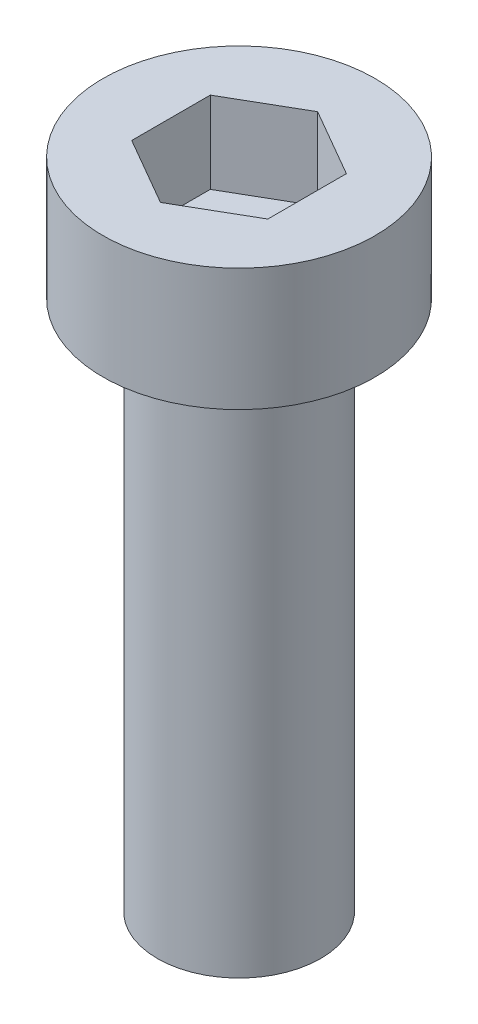
ISO-10303-21;
HEADER;
FILE_DESCRIPTION(('STEP AP214'),'2;1');
FILE_NAME('part.step','',(''),(''),'','','');
FILE_SCHEMA(('AUTOMOTIVE_DESIGN { 1 0 10303 214 1 1 1 1 }'));
ENDSEC;
DATA;
#1=APPLICATION_CONTEXT('core data for automotive mechanical design processes');
#2=APPLICATION_PROTOCOL_DEFINITION('international standard','automotive_design',2000,#1);
#3=PRODUCT_CONTEXT('',#1,'mechanical');
#4=PRODUCT('Part','Part','',(#3));
#5=PRODUCT_RELATED_PRODUCT_CATEGORY('part','',(#4));
#6=PRODUCT_DEFINITION_FORMATION('','',#4);
#7=PRODUCT_DEFINITION_CONTEXT('part definition',#1,'design');
#8=PRODUCT_DEFINITION('design','',#6,#7);
#9=PRODUCT_DEFINITION_SHAPE('','',#8);
#10=(LENGTH_UNIT() NAMED_UNIT(*) SI_UNIT(.MILLI.,.METRE.));
#11=(NAMED_UNIT(*) PLANE_ANGLE_UNIT() SI_UNIT($,.RADIAN.));
#12=(NAMED_UNIT(*) SI_UNIT($,.STERADIAN.) SOLID_ANGLE_UNIT());
#13=UNCERTAINTY_MEASURE_WITH_UNIT(LENGTH_MEASURE(1.E-05),#10,'distance_accuracy_value','');
#14=(GEOMETRIC_REPRESENTATION_CONTEXT(3) GLOBAL_UNCERTAINTY_ASSIGNED_CONTEXT((#13)) GLOBAL_UNIT_ASSIGNED_CONTEXT((#10,
#11,#12)) REPRESENTATION_CONTEXT('',''));
#15=CARTESIAN_POINT('',(0.,0.,0.));
#16=DIRECTION('',(0.,0.,1.));
#17=DIRECTION('',(1.,0.,0.));
#18=AXIS2_PLACEMENT_3D('',#15,#16,#17);
#19=CARTESIAN_POINT('',(0.,0.,0.));
#20=DIRECTION('',(0.,1.,0.));
#21=DIRECTION('',(0.,0.,1.));
#22=AXIS2_PLACEMENT_3D('',#19,#20,#21);
#23=PLANE('',#22);
#24=DIRECTION('',(-0.866025403784439,0.,-0.5));
#25=VECTOR('',#24,1.);
#26=CARTESIAN_POINT('',(2.5,0.,-1.44337567297407));
#27=LINE('',#26,#25);
#28=CARTESIAN_POINT('',(2.5,0.,-1.44337567297407));
#29=VERTEX_POINT('',#28);
#30=CARTESIAN_POINT('',(0.,0.,-2.88675134594813));
#31=VERTEX_POINT('',#30);
#32=EDGE_CURVE('E48',#29,#31,#27,.T.);
#33=ORIENTED_EDGE('',*,*,#32,.F.);
#34=DIRECTION('',(0.,0.,-1.));
#35=VECTOR('',#34,1.);
#36=CARTESIAN_POINT('',(2.5,0.,1.44337567297406));
#37=LINE('',#36,#35);
#38=CARTESIAN_POINT('',(2.5,0.,1.44337567297406));
#39=VERTEX_POINT('',#38);
#40=EDGE_CURVE('E131',#39,#29,#37,.T.);
#41=ORIENTED_EDGE('',*,*,#40,.F.);
#42=DIRECTION('',(0.866025403784439,0.,-0.5));
#43=VECTOR('',#42,1.);
#44=CARTESIAN_POINT('',(0.,0.,2.88675134594813));
#45=LINE('',#44,#43);
#46=CARTESIAN_POINT('',(0.,0.,2.88675134594813));
#47=VERTEX_POINT('',#46);
#48=EDGE_CURVE('E129',#47,#39,#45,.T.);
#49=ORIENTED_EDGE('',*,*,#48,.F.);
#50=DIRECTION('',(0.866025403784439,0.,0.5));
#51=VECTOR('',#50,1.);
#52=CARTESIAN_POINT('',(-2.5,0.,1.44337567297407));
#53=LINE('',#52,#51);
#54=CARTESIAN_POINT('',(-2.5,0.,1.44337567297407));
#55=VERTEX_POINT('',#54);
#56=EDGE_CURVE('E96',#55,#47,#53,.T.);
#57=ORIENTED_EDGE('',*,*,#56,.F.);
#58=DIRECTION('',(0.,0.,1.));
#59=VECTOR('',#58,1.);
#60=CARTESIAN_POINT('',(-2.5,0.,-1.44337567297406));
#61=LINE('',#60,#59);
#62=CARTESIAN_POINT('',(-2.5,0.,-1.44337567297406));
#63=VERTEX_POINT('',#62);
#64=EDGE_CURVE('E125',#63,#55,#61,.T.);
#65=ORIENTED_EDGE('',*,*,#64,.F.);
#66=DIRECTION('',(-0.866025403784439,0.,0.5));
#67=VECTOR('',#66,1.);
#68=CARTESIAN_POINT('',(0.,0.,-2.88675134594813));
#69=LINE('',#68,#67);
#70=EDGE_CURVE('E122',#31,#63,#69,.T.);
#71=ORIENTED_EDGE('',*,*,#70,.F.);
#72=EDGE_LOOP('',(#33,#41,#49,#57,#65,#71));
#73=FACE_BOUND('',#72,.T.);
#74=CARTESIAN_POINT('',(0.,0.,0.));
#75=DIRECTION('',(0.,-1.,0.));
#76=DIRECTION('',(0.,0.,-1.));
#77=AXIS2_PLACEMENT_3D('',#74,#75,#76);
#78=CIRCLE('',#77,5.);
#79=CARTESIAN_POINT('',(0.,0.,-5.));
#80=VERTEX_POINT('',#79);
#81=EDGE_CURVE('E11',#80,#80,#78,.T.);
#82=ORIENTED_EDGE('',*,*,#81,.F.);
#83=EDGE_LOOP('',(#82));
#84=FACE_BOUND('',#83,.T.);
#85=ADVANCED_FACE('F34',(#73,#84),#23,.T.);
#86=CARTESIAN_POINT('',(0.,0.,0.));
#87=DIRECTION('',(0.,-1.,0.));
#88=DIRECTION('',(0.,0.,-1.));
#89=AXIS2_PLACEMENT_3D('',#86,#87,#88);
#90=CYLINDRICAL_SURFACE('',#89,5.);
#91=ORIENTED_EDGE('',*,*,#81,.T.);
#92=EDGE_LOOP('',(#91));
#93=FACE_BOUND('',#92,.T.);
#94=CARTESIAN_POINT('',(0.,-4.5,0.));
#95=DIRECTION('',(0.,-1.,0.));
#96=DIRECTION('',(0.,0.,-1.));
#97=AXIS2_PLACEMENT_3D('',#94,#95,#96);
#98=CIRCLE('',#97,5.);
#99=CARTESIAN_POINT('',(0.,-4.5,-5.));
#100=VERTEX_POINT('',#99);
#101=EDGE_CURVE('E41',#100,#100,#98,.T.);
#102=ORIENTED_EDGE('',*,*,#101,.F.);
#103=EDGE_LOOP('',(#102));
#104=FACE_BOUND('',#103,.T.);
#105=ADVANCED_FACE('F151',(#93,#104),#90,.T.);
#106=CARTESIAN_POINT('',(5.,-4.5,0.));
#107=DIRECTION('',(0.,-1.,0.));
#108=DIRECTION('',(0.,0.,-1.));
#109=AXIS2_PLACEMENT_3D('',#106,#107,#108);
#110=PLANE('',#109);
#111=ORIENTED_EDGE('',*,*,#101,.T.);
#112=EDGE_LOOP('',(#111));
#113=FACE_BOUND('',#112,.T.);
#114=CARTESIAN_POINT('',(0.,-4.5,0.));
#115=DIRECTION('',(0.,-1.,0.));
#116=DIRECTION('',(0.,0.,-1.));
#117=AXIS2_PLACEMENT_3D('',#114,#115,#116);
#118=CIRCLE('',#117,3.);
#119=CARTESIAN_POINT('',(0.,-4.5,-3.));
#120=VERTEX_POINT('',#119);
#121=EDGE_CURVE('E143',#120,#120,#118,.T.);
#122=ORIENTED_EDGE('',*,*,#121,.F.);
#123=EDGE_LOOP('',(#122));
#124=FACE_BOUND('',#123,.T.);
#125=ADVANCED_FACE('F148',(#113,#124),#110,.T.);
#126=CARTESIAN_POINT('',(0.,0.,0.));
#127=DIRECTION('',(0.,-1.,0.));
#128=DIRECTION('',(0.,0.,-1.));
#129=AXIS2_PLACEMENT_3D('',#126,#127,#128);
#130=CYLINDRICAL_SURFACE('',#129,3.);
#131=ORIENTED_EDGE('',*,*,#121,.T.);
#132=EDGE_LOOP('',(#131));
#133=FACE_BOUND('',#132,.T.);
#134=CARTESIAN_POINT('',(0.,-24.,0.));
#135=DIRECTION('',(0.,-1.,0.));
#136=DIRECTION('',(0.,0.,-1.));
#137=AXIS2_PLACEMENT_3D('',#134,#135,#136);
#138=CIRCLE('',#137,3.);
#139=CARTESIAN_POINT('',(0.,-24.,-3.));
#140=VERTEX_POINT('',#139);
#141=EDGE_CURVE('E135',#140,#140,#138,.T.);
#142=ORIENTED_EDGE('',*,*,#141,.F.);
#143=EDGE_LOOP('',(#142));
#144=FACE_BOUND('',#143,.T.);
#145=ADVANCED_FACE('F158',(#133,#144),#130,.T.);
#146=CARTESIAN_POINT('',(2.50000000000001,-24.,0.));
#147=DIRECTION('',(0.,-1.,0.));
#148=DIRECTION('',(0.,0.,-1.));
#149=AXIS2_PLACEMENT_3D('',#146,#147,#148);
#150=PLANE('',#149);
#151=ORIENTED_EDGE('',*,*,#141,.T.);
#152=EDGE_LOOP('',(#151));
#153=FACE_BOUND('',#152,.T.);
#154=ADVANCED_FACE('F164',(#153),#150,.T.);
#155=CARTESIAN_POINT('',(2.5,-3.,-1.44337567297407));
#156=DIRECTION('',(0.5,0.,-0.866025403784439));
#157=DIRECTION('',(-0.866025403784439,0.,-0.5));
#158=AXIS2_PLACEMENT_3D('',#155,#156,#157);
#159=PLANE('',#158);
#160=ORIENTED_EDGE('',*,*,#32,.T.);
#161=DIRECTION('',(0.,1.,0.));
#162=VECTOR('',#161,1.);
#163=CARTESIAN_POINT('',(0.,-3.,-2.88675134594813));
#164=LINE('',#163,#162);
#165=CARTESIAN_POINT('',(0.,-3.,-2.88675134594813));
#166=VERTEX_POINT('',#165);
#167=EDGE_CURVE('E78',#166,#31,#164,.T.);
#168=ORIENTED_EDGE('',*,*,#167,.F.);
#169=DIRECTION('',(-0.866025403784439,0.,-0.5));
#170=VECTOR('',#169,1.);
#171=CARTESIAN_POINT('',(2.5,-3.,-1.44337567297407));
#172=LINE('',#171,#170);
#173=CARTESIAN_POINT('',(2.5,-3.,-1.44337567297407));
#174=VERTEX_POINT('',#173);
#175=EDGE_CURVE('E133',#174,#166,#172,.T.);
#176=ORIENTED_EDGE('',*,*,#175,.F.);
#177=DIRECTION('',(0.,1.,0.));
#178=VECTOR('',#177,1.);
#179=CARTESIAN_POINT('',(2.5,-3.,-1.44337567297407));
#180=LINE('',#179,#178);
#181=EDGE_CURVE('E56',#174,#29,#180,.T.);
#182=ORIENTED_EDGE('',*,*,#181,.T.);
#183=EDGE_LOOP('',(#160,#168,#176,#182));
#184=FACE_BOUND('',#183,.T.);
#185=ADVANCED_FACE('F168',(#184),#159,.F.);
#186=CARTESIAN_POINT('',(2.5,-3.,1.44337567297406));
#187=DIRECTION('',(1.,0.,0.));
#188=DIRECTION('',(0.,0.,-1.));
#189=AXIS2_PLACEMENT_3D('',#186,#187,#188);
#190=PLANE('',#189);
#191=ORIENTED_EDGE('',*,*,#40,.T.);
#192=ORIENTED_EDGE('',*,*,#181,.F.);
#193=DIRECTION('',(0.,0.,-1.));
#194=VECTOR('',#193,1.);
#195=CARTESIAN_POINT('',(2.5,-3.,1.44337567297406));
#196=LINE('',#195,#194);
#197=CARTESIAN_POINT('',(2.5,-3.,1.44337567297406));
#198=VERTEX_POINT('',#197);
#199=EDGE_CURVE('E108',#198,#174,#196,.T.);
#200=ORIENTED_EDGE('',*,*,#199,.F.);
#201=DIRECTION('',(0.,1.,0.));
#202=VECTOR('',#201,1.);
#203=CARTESIAN_POINT('',(2.5,-3.,1.44337567297406));
#204=LINE('',#203,#202);
#205=EDGE_CURVE('E100',#198,#39,#204,.T.);
#206=ORIENTED_EDGE('',*,*,#205,.T.);
#207=EDGE_LOOP('',(#191,#192,#200,#206));
#208=FACE_BOUND('',#207,.T.);
#209=ADVANCED_FACE('F172',(#208),#190,.F.);
#210=CARTESIAN_POINT('',(0.,-3.,2.88675134594813));
#211=DIRECTION('',(0.5,0.,0.866025403784439));
#212=DIRECTION('',(0.866025403784439,0.,-0.5));
#213=AXIS2_PLACEMENT_3D('',#210,#211,#212);
#214=PLANE('',#213);
#215=ORIENTED_EDGE('',*,*,#48,.T.);
#216=ORIENTED_EDGE('',*,*,#205,.F.);
#217=DIRECTION('',(0.866025403784439,0.,-0.5));
#218=VECTOR('',#217,1.);
#219=CARTESIAN_POINT('',(0.,-3.,2.88675134594813));
#220=LINE('',#219,#218);
#221=CARTESIAN_POINT('',(0.,-3.,2.88675134594813));
#222=VERTEX_POINT('',#221);
#223=EDGE_CURVE('E104',#222,#198,#220,.T.);
#224=ORIENTED_EDGE('',*,*,#223,.F.);
#225=DIRECTION('',(0.,1.,0.));
#226=VECTOR('',#225,1.);
#227=CARTESIAN_POINT('',(0.,-3.,2.88675134594813));
#228=LINE('',#227,#226);
#229=EDGE_CURVE('E89',#222,#47,#228,.T.);
#230=ORIENTED_EDGE('',*,*,#229,.T.);
#231=EDGE_LOOP('',(#215,#216,#224,#230));
#232=FACE_BOUND('',#231,.T.);
#233=ADVANCED_FACE('F105',(#232),#214,.F.);
#234=CARTESIAN_POINT('',(-2.5,-3.,1.44337567297407));
#235=DIRECTION('',(-0.5,0.,0.866025403784439));
#236=DIRECTION('',(0.866025403784439,0.,0.5));
#237=AXIS2_PLACEMENT_3D('',#234,#235,#236);
#238=PLANE('',#237);
#239=ORIENTED_EDGE('',*,*,#56,.T.);
#240=ORIENTED_EDGE('',*,*,#229,.F.);
#241=DIRECTION('',(0.866025403784439,0.,0.5));
#242=VECTOR('',#241,1.);
#243=CARTESIAN_POINT('',(-2.5,-3.,1.44337567297407));
#244=LINE('',#243,#242);
#245=CARTESIAN_POINT('',(-2.5,-3.,1.44337567297407));
#246=VERTEX_POINT('',#245);
#247=EDGE_CURVE('E93',#246,#222,#244,.T.);
#248=ORIENTED_EDGE('',*,*,#247,.F.);
#249=DIRECTION('',(0.,1.,0.));
#250=VECTOR('',#249,1.);
#251=CARTESIAN_POINT('',(-2.5,-3.,1.44337567297407));
#252=LINE('',#251,#250);
#253=EDGE_CURVE('E101',#246,#55,#252,.T.);
#254=ORIENTED_EDGE('',*,*,#253,.T.);
#255=EDGE_LOOP('',(#239,#240,#248,#254));
#256=FACE_BOUND('',#255,.T.);
#257=ADVANCED_FACE('F91',(#256),#238,.F.);
#258=CARTESIAN_POINT('',(-2.5,-3.,-1.44337567297406));
#259=DIRECTION('',(-1.,0.,0.));
#260=DIRECTION('',(0.,0.,1.));
#261=AXIS2_PLACEMENT_3D('',#258,#259,#260);
#262=PLANE('',#261);
#263=ORIENTED_EDGE('',*,*,#64,.T.);
#264=ORIENTED_EDGE('',*,*,#253,.F.);
#265=DIRECTION('',(0.,0.,1.));
#266=VECTOR('',#265,1.);
#267=CARTESIAN_POINT('',(-2.5,-3.,-1.44337567297406));
#268=LINE('',#267,#266);
#269=CARTESIAN_POINT('',(-2.5,-3.,-1.44337567297406));
#270=VERTEX_POINT('',#269);
#271=EDGE_CURVE('E114',#270,#246,#268,.T.);
#272=ORIENTED_EDGE('',*,*,#271,.F.);
#273=DIRECTION('',(0.,1.,0.));
#274=VECTOR('',#273,1.);
#275=CARTESIAN_POINT('',(-2.5,-3.,-1.44337567297406));
#276=LINE('',#275,#274);
#277=EDGE_CURVE('E138',#270,#63,#276,.T.);
#278=ORIENTED_EDGE('',*,*,#277,.T.);
#279=EDGE_LOOP('',(#263,#264,#272,#278));
#280=FACE_BOUND('',#279,.T.);
#281=ADVANCED_FACE('F176',(#280),#262,.F.);
#282=CARTESIAN_POINT('',(0.,-3.,-2.88675134594813));
#283=DIRECTION('',(-0.5,0.,-0.866025403784439));
#284=DIRECTION('',(-0.866025403784439,0.,0.5));
#285=AXIS2_PLACEMENT_3D('',#282,#283,#284);
#286=PLANE('',#285);
#287=ORIENTED_EDGE('',*,*,#70,.T.);
#288=ORIENTED_EDGE('',*,*,#277,.F.);
#289=DIRECTION('',(-0.866025403784439,0.,0.5));
#290=VECTOR('',#289,1.);
#291=CARTESIAN_POINT('',(0.,-3.,-2.88675134594813));
#292=LINE('',#291,#290);
#293=EDGE_CURVE('E116',#166,#270,#292,.T.);
#294=ORIENTED_EDGE('',*,*,#293,.F.);
#295=ORIENTED_EDGE('',*,*,#167,.T.);
#296=EDGE_LOOP('',(#287,#288,#294,#295));
#297=FACE_BOUND('',#296,.T.);
#298=ADVANCED_FACE('F173',(#297),#286,.F.);
#299=CARTESIAN_POINT('',(0.,-3.,0.));
#300=DIRECTION('',(0.,1.,0.));
#301=DIRECTION('',(0.,0.,1.));
#302=AXIS2_PLACEMENT_3D('',#299,#300,#301);
#303=PLANE('',#302);
#304=ORIENTED_EDGE('',*,*,#175,.T.);
#305=ORIENTED_EDGE('',*,*,#293,.T.);
#306=ORIENTED_EDGE('',*,*,#271,.T.);
#307=ORIENTED_EDGE('',*,*,#247,.T.);
#308=ORIENTED_EDGE('',*,*,#223,.T.);
#309=ORIENTED_EDGE('',*,*,#199,.T.);
#310=EDGE_LOOP('',(#304,#305,#306,#307,#308,#309));
#311=FACE_BOUND('',#310,.T.);
#312=ADVANCED_FACE('F111',(#311),#303,.T.);
#313=CLOSED_SHELL('',(#85,#105,#125,#145,#154,#185,#209,#233,#257,#281,#298,#312));
#314=MANIFOLD_SOLID_BREP('B2',#313);
#315=ADVANCED_BREP_SHAPE_REPRESENTATION('',(#18,#314),#14);
#316=SHAPE_DEFINITION_REPRESENTATION(#9,#315);
ENDSEC;
END-ISO-10303-21;
